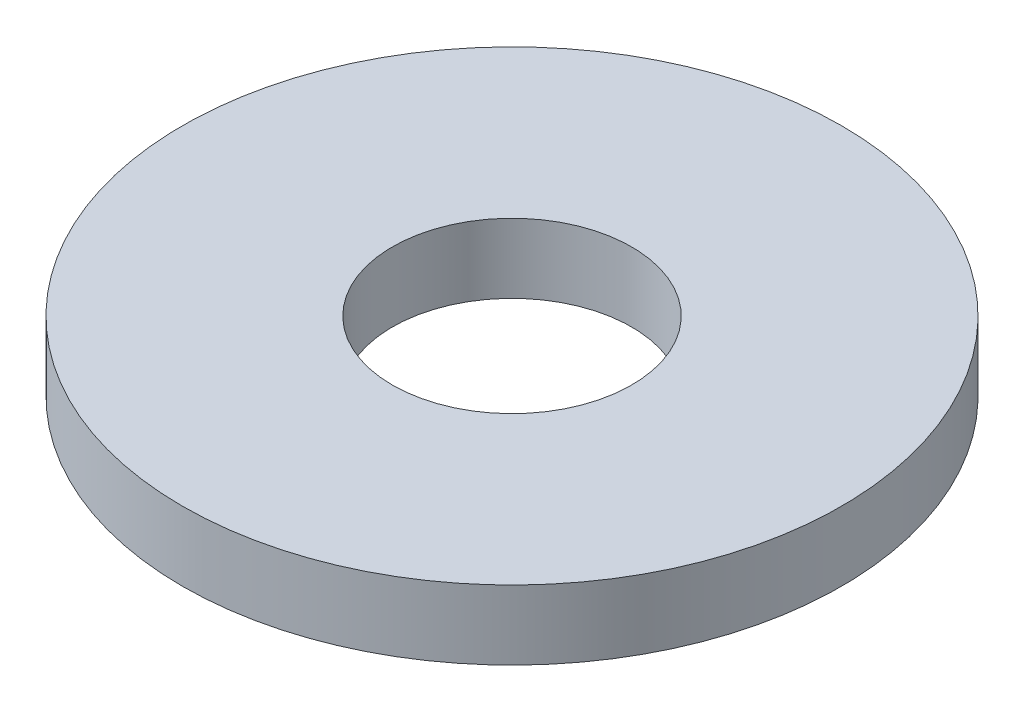
ISO-10303-21;
HEADER;
FILE_DESCRIPTION(('STEP AP214'),'2;1');
FILE_NAME('part.step','',(''),(''),'','','');
FILE_SCHEMA(('AUTOMOTIVE_DESIGN { 1 0 10303 214 1 1 1 1 }'));
ENDSEC;
DATA;
#1=APPLICATION_CONTEXT('core data for automotive mechanical design processes');
#2=APPLICATION_PROTOCOL_DEFINITION('international standard','automotive_design',2000,#1);
#3=PRODUCT_CONTEXT('',#1,'mechanical');
#4=PRODUCT('Part','Part','',(#3));
#5=PRODUCT_RELATED_PRODUCT_CATEGORY('part','',(#4));
#6=PRODUCT_DEFINITION_FORMATION('','',#4);
#7=PRODUCT_DEFINITION_CONTEXT('part definition',#1,'design');
#8=PRODUCT_DEFINITION('design','',#6,#7);
#9=PRODUCT_DEFINITION_SHAPE('','',#8);
#10=(LENGTH_UNIT() NAMED_UNIT(*) SI_UNIT(.MILLI.,.METRE.));
#11=(NAMED_UNIT(*) PLANE_ANGLE_UNIT() SI_UNIT($,.RADIAN.));
#12=(NAMED_UNIT(*) SI_UNIT($,.STERADIAN.) SOLID_ANGLE_UNIT());
#13=UNCERTAINTY_MEASURE_WITH_UNIT(LENGTH_MEASURE(1.E-05),#10,'distance_accuracy_value','');
#14=(GEOMETRIC_REPRESENTATION_CONTEXT(3) GLOBAL_UNCERTAINTY_ASSIGNED_CONTEXT((#13)) GLOBAL_UNIT_ASSIGNED_CONTEXT((#10,
#11,#12)) REPRESENTATION_CONTEXT('',''));
#15=CARTESIAN_POINT('',(0.,0.,0.));
#16=DIRECTION('',(0.,0.,1.));
#17=DIRECTION('',(1.,0.,0.));
#18=AXIS2_PLACEMENT_3D('',#15,#16,#17);
#19=CARTESIAN_POINT('',(0.,2.,0.));
#20=DIRECTION('',(0.,1.,0.));
#21=DIRECTION('',(0.,0.,1.));
#22=AXIS2_PLACEMENT_3D('',#19,#20,#21);
#23=PLANE('',#22);
#24=CARTESIAN_POINT('',(0.,2.,0.));
#25=DIRECTION('',(0.,1.,0.));
#26=DIRECTION('',(0.,0.,1.));
#27=AXIS2_PLACEMENT_3D('',#24,#25,#26);
#28=CIRCLE('',#27,9.5);
#29=CARTESIAN_POINT('',(0.,2.,9.5));
#30=VERTEX_POINT('',#29);
#31=EDGE_CURVE('E10',#30,#30,#28,.T.);
#32=ORIENTED_EDGE('',*,*,#31,.T.);
#33=EDGE_LOOP('',(#32));
#34=FACE_BOUND('',#33,.T.);
#35=CARTESIAN_POINT('',(0.,2.,0.));
#36=DIRECTION('',(0.,1.,0.));
#37=DIRECTION('',(0.,0.,1.));
#38=AXIS2_PLACEMENT_3D('',#35,#36,#37);
#39=CIRCLE('',#38,3.45);
#40=CARTESIAN_POINT('',(0.,2.,3.45));
#41=VERTEX_POINT('',#40);
#42=EDGE_CURVE('E50',#41,#41,#39,.T.);
#43=ORIENTED_EDGE('',*,*,#42,.F.);
#44=EDGE_LOOP('',(#43));
#45=FACE_BOUND('',#44,.T.);
#46=ADVANCED_FACE('F39',(#34,#45),#23,.T.);
#47=CARTESIAN_POINT('',(0.,0.,0.));
#48=DIRECTION('',(0.,1.,0.));
#49=DIRECTION('',(0.,0.,1.));
#50=AXIS2_PLACEMENT_3D('',#47,#48,#49);
#51=PLANE('',#50);
#52=CARTESIAN_POINT('',(0.,0.,0.));
#53=DIRECTION('',(0.,1.,0.));
#54=DIRECTION('',(0.,0.,1.));
#55=AXIS2_PLACEMENT_3D('',#52,#53,#54);
#56=CIRCLE('',#55,9.5);
#57=CARTESIAN_POINT('',(0.,0.,9.5));
#58=VERTEX_POINT('',#57);
#59=EDGE_CURVE('E43',#58,#58,#56,.T.);
#60=ORIENTED_EDGE('',*,*,#59,.F.);
#61=EDGE_LOOP('',(#60));
#62=FACE_BOUND('',#61,.T.);
#63=CARTESIAN_POINT('',(0.,0.,0.));
#64=DIRECTION('',(0.,1.,0.));
#65=DIRECTION('',(0.,0.,1.));
#66=AXIS2_PLACEMENT_3D('',#63,#64,#65);
#67=CIRCLE('',#66,3.45);
#68=CARTESIAN_POINT('',(0.,0.,3.45));
#69=VERTEX_POINT('',#68);
#70=EDGE_CURVE('E52',#69,#69,#67,.T.);
#71=ORIENTED_EDGE('',*,*,#70,.T.);
#72=EDGE_LOOP('',(#71));
#73=FACE_BOUND('',#72,.T.);
#74=ADVANCED_FACE('F62',(#62,#73),#51,.F.);
#75=CARTESIAN_POINT('',(0.,2.,0.));
#76=DIRECTION('',(0.,-1.,0.));
#77=DIRECTION('',(0.,0.,-1.));
#78=AXIS2_PLACEMENT_3D('',#75,#76,#77);
#79=CYLINDRICAL_SURFACE('',#78,9.5);
#80=ORIENTED_EDGE('',*,*,#31,.F.);
#81=EDGE_LOOP('',(#80));
#82=FACE_BOUND('',#81,.T.);
#83=ORIENTED_EDGE('',*,*,#59,.T.);
#84=EDGE_LOOP('',(#83));
#85=FACE_BOUND('',#84,.T.);
#86=ADVANCED_FACE('F41',(#82,#85),#79,.T.);
#87=CARTESIAN_POINT('',(0.,2.,0.));
#88=DIRECTION('',(0.,-1.,0.));
#89=DIRECTION('',(0.,0.,-1.));
#90=AXIS2_PLACEMENT_3D('',#87,#88,#89);
#91=CYLINDRICAL_SURFACE('',#90,3.45);
#92=ORIENTED_EDGE('',*,*,#42,.T.);
#93=EDGE_LOOP('',(#92));
#94=FACE_BOUND('',#93,.T.);
#95=ORIENTED_EDGE('',*,*,#70,.F.);
#96=EDGE_LOOP('',(#95));
#97=FACE_BOUND('',#96,.T.);
#98=ADVANCED_FACE('F58',(#94,#97),#91,.F.);
#99=CLOSED_SHELL('',(#46,#74,#86,#98));
#100=MANIFOLD_SOLID_BREP('B2',#99);
#101=ADVANCED_BREP_SHAPE_REPRESENTATION('',(#18,#100),#14);
#102=SHAPE_DEFINITION_REPRESENTATION(#9,#101);
ENDSEC;
END-ISO-10303-21;
